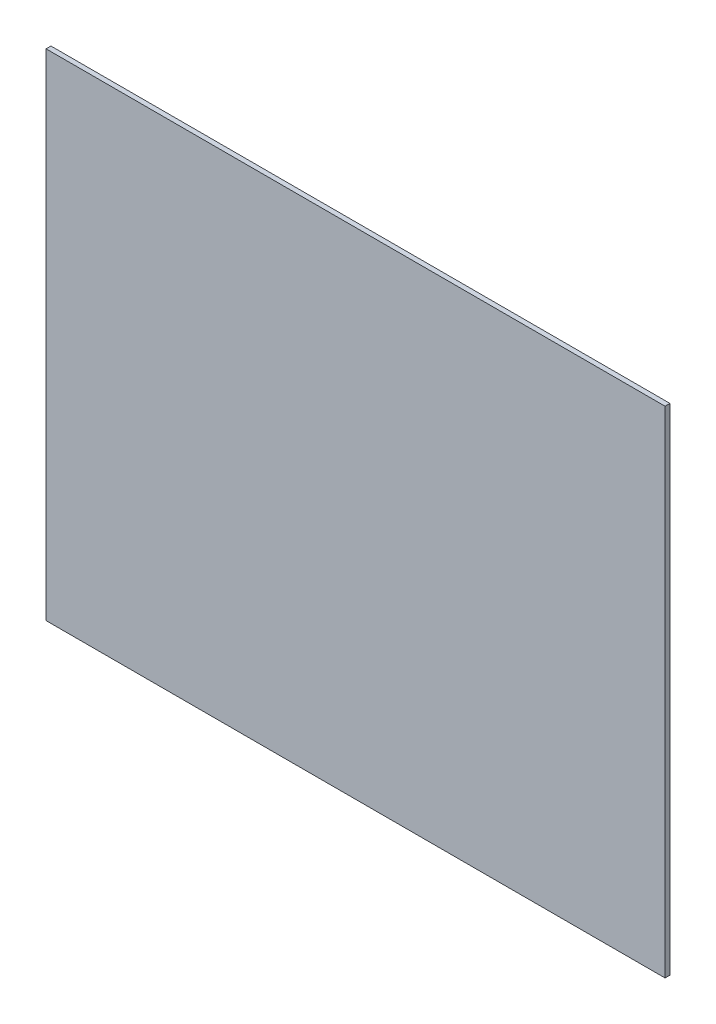
ISO-10303-21;
HEADER;
FILE_DESCRIPTION(('STEP AP214'),'2;1');
FILE_NAME('part.step','',(''),(''),'','','');
FILE_SCHEMA(('AUTOMOTIVE_DESIGN { 1 0 10303 214 1 1 1 1 }'));
ENDSEC;
DATA;
#1=APPLICATION_CONTEXT('core data for automotive mechanical design processes');
#2=APPLICATION_PROTOCOL_DEFINITION('international standard','automotive_design',2000,#1);
#3=PRODUCT_CONTEXT('',#1,'mechanical');
#4=PRODUCT('Part','Part','',(#3));
#5=PRODUCT_RELATED_PRODUCT_CATEGORY('part','',(#4));
#6=PRODUCT_DEFINITION_FORMATION('','',#4);
#7=PRODUCT_DEFINITION_CONTEXT('part definition',#1,'design');
#8=PRODUCT_DEFINITION('design','',#6,#7);
#9=PRODUCT_DEFINITION_SHAPE('','',#8);
#10=(LENGTH_UNIT() NAMED_UNIT(*) SI_UNIT(.MILLI.,.METRE.));
#11=(NAMED_UNIT(*) PLANE_ANGLE_UNIT() SI_UNIT($,.RADIAN.));
#12=(NAMED_UNIT(*) SI_UNIT($,.STERADIAN.) SOLID_ANGLE_UNIT());
#13=UNCERTAINTY_MEASURE_WITH_UNIT(LENGTH_MEASURE(1.E-05),#10,'distance_accuracy_value','');
#14=(GEOMETRIC_REPRESENTATION_CONTEXT(3) GLOBAL_UNCERTAINTY_ASSIGNED_CONTEXT((#13)) GLOBAL_UNIT_ASSIGNED_CONTEXT((#10,
#11,#12)) REPRESENTATION_CONTEXT('',''));
#15=CARTESIAN_POINT('',(0.,0.,0.));
#16=DIRECTION('',(0.,0.,1.));
#17=DIRECTION('',(1.,0.,0.));
#18=AXIS2_PLACEMENT_3D('',#15,#16,#17);
#19=CARTESIAN_POINT('',(95.25,76.2,1.5));
#20=DIRECTION('',(-1.,0.,0.));
#21=DIRECTION('',(0.,-1.,0.));
#22=AXIS2_PLACEMENT_3D('',#19,#20,#21);
#23=PLANE('',#22);
#24=DIRECTION('',(0.,1.,0.));
#25=VECTOR('',#24,1.);
#26=CARTESIAN_POINT('',(95.25,76.2,0.));
#27=LINE('',#26,#25);
#28=CARTESIAN_POINT('',(95.25,-76.2,0.));
#29=VERTEX_POINT('',#28);
#30=CARTESIAN_POINT('',(95.25,76.2,0.));
#31=VERTEX_POINT('',#30);
#32=EDGE_CURVE('E96',#29,#31,#27,.T.);
#33=ORIENTED_EDGE('',*,*,#32,.T.);
#34=DIRECTION('',(0.,0.,-1.));
#35=VECTOR('',#34,1.);
#36=CARTESIAN_POINT('',(95.25,76.2,1.5));
#37=LINE('',#36,#35);
#38=CARTESIAN_POINT('',(95.25,76.2,1.5));
#39=VERTEX_POINT('',#38);
#40=EDGE_CURVE('E11',#39,#31,#37,.T.);
#41=ORIENTED_EDGE('',*,*,#40,.F.);
#42=DIRECTION('',(0.,1.,0.));
#43=VECTOR('',#42,1.);
#44=CARTESIAN_POINT('',(95.25,76.2,1.5));
#45=LINE('',#44,#43);
#46=CARTESIAN_POINT('',(95.25,-76.2,1.5));
#47=VERTEX_POINT('',#46);
#48=EDGE_CURVE('E84',#47,#39,#45,.T.);
#49=ORIENTED_EDGE('',*,*,#48,.F.);
#50=DIRECTION('',(0.,0.,-1.));
#51=VECTOR('',#50,1.);
#52=CARTESIAN_POINT('',(95.25,-76.2,1.5));
#53=LINE('',#52,#51);
#54=EDGE_CURVE('E92',#47,#29,#53,.T.);
#55=ORIENTED_EDGE('',*,*,#54,.T.);
#56=EDGE_LOOP('',(#33,#41,#49,#55));
#57=FACE_BOUND('',#56,.T.);
#58=ADVANCED_FACE('F33',(#57),#23,.F.);
#59=CARTESIAN_POINT('',(-95.25,76.2,1.5));
#60=DIRECTION('',(0.,-1.,0.));
#61=DIRECTION('',(0.,0.,-1.));
#62=AXIS2_PLACEMENT_3D('',#59,#60,#61);
#63=PLANE('',#62);
#64=DIRECTION('',(-1.,0.,0.));
#65=VECTOR('',#64,1.);
#66=CARTESIAN_POINT('',(-95.25,76.2,0.));
#67=LINE('',#66,#65);
#68=CARTESIAN_POINT('',(-95.25,76.2,0.));
#69=VERTEX_POINT('',#68);
#70=EDGE_CURVE('E88',#31,#69,#67,.T.);
#71=ORIENTED_EDGE('',*,*,#70,.T.);
#72=DIRECTION('',(0.,0.,-1.));
#73=VECTOR('',#72,1.);
#74=CARTESIAN_POINT('',(-95.25,76.2,1.5));
#75=LINE('',#74,#73);
#76=CARTESIAN_POINT('',(-95.25,76.2,1.5));
#77=VERTEX_POINT('',#76);
#78=EDGE_CURVE('E41',#77,#69,#75,.T.);
#79=ORIENTED_EDGE('',*,*,#78,.F.);
#80=DIRECTION('',(-1.,0.,0.));
#81=VECTOR('',#80,1.);
#82=CARTESIAN_POINT('',(-95.25,76.2,1.5));
#83=LINE('',#82,#81);
#84=EDGE_CURVE('E79',#39,#77,#83,.T.);
#85=ORIENTED_EDGE('',*,*,#84,.F.);
#86=ORIENTED_EDGE('',*,*,#40,.T.);
#87=EDGE_LOOP('',(#71,#79,#85,#86));
#88=FACE_BOUND('',#87,.T.);
#89=ADVANCED_FACE('F87',(#88),#63,.F.);
#90=CARTESIAN_POINT('',(-95.25,76.2,1.5));
#91=DIRECTION('',(1.,0.,0.));
#92=DIRECTION('',(0.,1.,0.));
#93=AXIS2_PLACEMENT_3D('',#90,#91,#92);
#94=PLANE('',#93);
#95=DIRECTION('',(0.,-1.,0.));
#96=VECTOR('',#95,1.);
#97=CARTESIAN_POINT('',(-95.25,76.2,0.));
#98=LINE('',#97,#96);
#99=CARTESIAN_POINT('',(-95.25,-76.2,0.));
#100=VERTEX_POINT('',#99);
#101=EDGE_CURVE('E66',#69,#100,#98,.T.);
#102=ORIENTED_EDGE('',*,*,#101,.T.);
#103=DIRECTION('',(0.,0.,-1.));
#104=VECTOR('',#103,1.);
#105=CARTESIAN_POINT('',(-95.25,-76.2,1.5));
#106=LINE('',#105,#104);
#107=CARTESIAN_POINT('',(-95.25,-76.2,1.5));
#108=VERTEX_POINT('',#107);
#109=EDGE_CURVE('E89',#108,#100,#106,.T.);
#110=ORIENTED_EDGE('',*,*,#109,.F.);
#111=DIRECTION('',(0.,-1.,0.));
#112=VECTOR('',#111,1.);
#113=CARTESIAN_POINT('',(-95.25,76.2,1.5));
#114=LINE('',#113,#112);
#115=EDGE_CURVE('E82',#77,#108,#114,.T.);
#116=ORIENTED_EDGE('',*,*,#115,.F.);
#117=ORIENTED_EDGE('',*,*,#78,.T.);
#118=EDGE_LOOP('',(#102,#110,#116,#117));
#119=FACE_BOUND('',#118,.T.);
#120=ADVANCED_FACE('F90',(#119),#94,.F.);
#121=CARTESIAN_POINT('',(-95.25,-76.2,1.5));
#122=DIRECTION('',(0.,1.,0.));
#123=DIRECTION('',(0.,0.,1.));
#124=AXIS2_PLACEMENT_3D('',#121,#122,#123);
#125=PLANE('',#124);
#126=DIRECTION('',(1.,0.,0.));
#127=VECTOR('',#126,1.);
#128=CARTESIAN_POINT('',(-95.25,-76.2,0.));
#129=LINE('',#128,#127);
#130=EDGE_CURVE('E72',#100,#29,#129,.T.);
#131=ORIENTED_EDGE('',*,*,#130,.T.);
#132=ORIENTED_EDGE('',*,*,#54,.F.);
#133=DIRECTION('',(1.,0.,0.));
#134=VECTOR('',#133,1.);
#135=CARTESIAN_POINT('',(-95.25,-76.2,1.5));
#136=LINE('',#135,#134);
#137=EDGE_CURVE('E49',#108,#47,#136,.T.);
#138=ORIENTED_EDGE('',*,*,#137,.F.);
#139=ORIENTED_EDGE('',*,*,#109,.T.);
#140=EDGE_LOOP('',(#131,#132,#138,#139));
#141=FACE_BOUND('',#140,.T.);
#142=ADVANCED_FACE('F103',(#141),#125,.F.);
#143=CARTESIAN_POINT('',(0.,0.,1.5));
#144=DIRECTION('',(0.,0.,1.));
#145=DIRECTION('',(1.,0.,0.));
#146=AXIS2_PLACEMENT_3D('',#143,#144,#145);
#147=PLANE('',#146);
#148=ORIENTED_EDGE('',*,*,#48,.T.);
#149=ORIENTED_EDGE('',*,*,#84,.T.);
#150=ORIENTED_EDGE('',*,*,#115,.T.);
#151=ORIENTED_EDGE('',*,*,#137,.T.);
#152=EDGE_LOOP('',(#148,#149,#150,#151));
#153=FACE_BOUND('',#152,.T.);
#154=ADVANCED_FACE('F80',(#153),#147,.T.);
#155=CARTESIAN_POINT('',(0.,0.,0.));
#156=DIRECTION('',(0.,0.,1.));
#157=DIRECTION('',(1.,0.,0.));
#158=AXIS2_PLACEMENT_3D('',#155,#156,#157);
#159=PLANE('',#158);
#160=ORIENTED_EDGE('',*,*,#32,.F.);
#161=ORIENTED_EDGE('',*,*,#130,.F.);
#162=ORIENTED_EDGE('',*,*,#101,.F.);
#163=ORIENTED_EDGE('',*,*,#70,.F.);
#164=EDGE_LOOP('',(#160,#161,#162,#163));
#165=FACE_BOUND('',#164,.T.);
#166=ADVANCED_FACE('F106',(#165),#159,.F.);
#167=CLOSED_SHELL('',(#58,#89,#120,#142,#154,#166));
#168=MANIFOLD_SOLID_BREP('B2',#167);
#169=ADVANCED_BREP_SHAPE_REPRESENTATION('',(#18,#168),#14);
#170=SHAPE_DEFINITION_REPRESENTATION(#9,#169);
ENDSEC;
END-ISO-10303-21;
